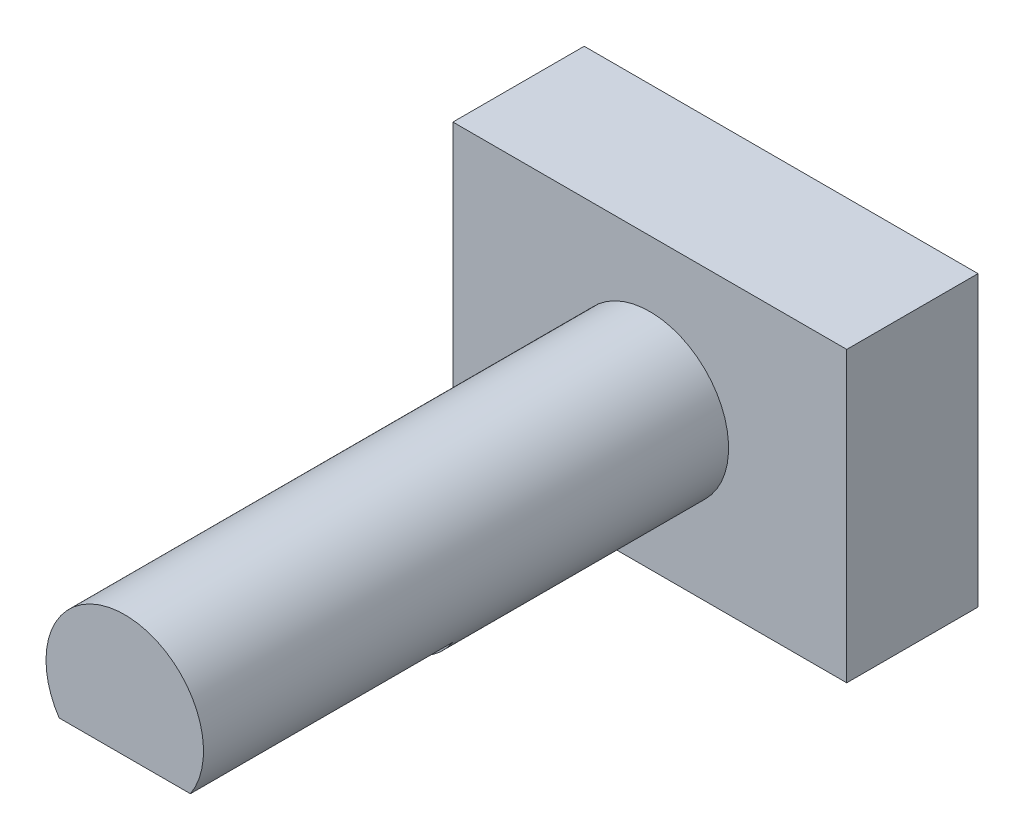
ISO-10303-21;
HEADER;
FILE_DESCRIPTION(('STEP AP214'),'2;1');
FILE_NAME('part.step','',(''),(''),'','','');
FILE_SCHEMA(('AUTOMOTIVE_DESIGN { 1 0 10303 214 1 1 1 1 }'));
ENDSEC;
DATA;
#1=APPLICATION_CONTEXT('core data for automotive mechanical design processes');
#2=APPLICATION_PROTOCOL_DEFINITION('international standard','automotive_design',2000,#1);
#3=PRODUCT_CONTEXT('',#1,'mechanical');
#4=PRODUCT('Part','Part','',(#3));
#5=PRODUCT_RELATED_PRODUCT_CATEGORY('part','',(#4));
#6=PRODUCT_DEFINITION_FORMATION('','',#4);
#7=PRODUCT_DEFINITION_CONTEXT('part definition',#1,'design');
#8=PRODUCT_DEFINITION('design','',#6,#7);
#9=PRODUCT_DEFINITION_SHAPE('','',#8);
#10=(LENGTH_UNIT() NAMED_UNIT(*) SI_UNIT(.MILLI.,.METRE.));
#11=(NAMED_UNIT(*) PLANE_ANGLE_UNIT() SI_UNIT($,.RADIAN.));
#12=(NAMED_UNIT(*) SI_UNIT($,.STERADIAN.) SOLID_ANGLE_UNIT());
#13=UNCERTAINTY_MEASURE_WITH_UNIT(LENGTH_MEASURE(1.E-05),#10,'distance_accuracy_value','');
#14=(GEOMETRIC_REPRESENTATION_CONTEXT(3) GLOBAL_UNCERTAINTY_ASSIGNED_CONTEXT((#13)) GLOBAL_UNIT_ASSIGNED_CONTEXT((#10,
#11,#12)) REPRESENTATION_CONTEXT('',''));
#15=CARTESIAN_POINT('',(0.,0.,0.));
#16=DIRECTION('',(0.,0.,1.));
#17=DIRECTION('',(1.,0.,0.));
#18=AXIS2_PLACEMENT_3D('',#15,#16,#17);
#19=CARTESIAN_POINT('',(-7.5,-5.5,5.));
#20=DIRECTION('',(1.,0.,0.));
#21=DIRECTION('',(0.,0.,-1.));
#22=AXIS2_PLACEMENT_3D('',#19,#20,#21);
#23=PLANE('',#22);
#24=DIRECTION('',(0.,-1.,0.));
#25=VECTOR('',#24,1.);
#26=CARTESIAN_POINT('',(-7.5,-5.5,0.));
#27=LINE('',#26,#25);
#28=CARTESIAN_POINT('',(-7.5,5.5,0.));
#29=VERTEX_POINT('',#28);
#30=CARTESIAN_POINT('',(-7.5,-5.5,0.));
#31=VERTEX_POINT('',#30);
#32=EDGE_CURVE('E116',#29,#31,#27,.T.);
#33=ORIENTED_EDGE('',*,*,#32,.T.);
#34=DIRECTION('',(0.,0.,-1.));
#35=VECTOR('',#34,1.);
#36=CARTESIAN_POINT('',(-7.5,-5.5,5.));
#37=LINE('',#36,#35);
#38=CARTESIAN_POINT('',(-7.5,-5.5,5.));
#39=VERTEX_POINT('',#38);
#40=EDGE_CURVE('E40',#39,#31,#37,.T.);
#41=ORIENTED_EDGE('',*,*,#40,.F.);
#42=DIRECTION('',(0.,-1.,0.));
#43=VECTOR('',#42,1.);
#44=CARTESIAN_POINT('',(-7.5,-5.5,5.));
#45=LINE('',#44,#43);
#46=CARTESIAN_POINT('',(-7.5,5.5,5.));
#47=VERTEX_POINT('',#46);
#48=EDGE_CURVE('E117',#47,#39,#45,.T.);
#49=ORIENTED_EDGE('',*,*,#48,.F.);
#50=DIRECTION('',(0.,0.,-1.));
#51=VECTOR('',#50,1.);
#52=CARTESIAN_POINT('',(-7.5,5.5,5.));
#53=LINE('',#52,#51);
#54=EDGE_CURVE('E123',#47,#29,#53,.T.);
#55=ORIENTED_EDGE('',*,*,#54,.T.);
#56=EDGE_LOOP('',(#33,#41,#49,#55));
#57=FACE_BOUND('',#56,.T.);
#58=ADVANCED_FACE('F33',(#57),#23,.F.);
#59=CARTESIAN_POINT('',(-7.5,-5.5,5.));
#60=DIRECTION('',(0.,1.,0.));
#61=DIRECTION('',(0.,0.,1.));
#62=AXIS2_PLACEMENT_3D('',#59,#60,#61);
#63=PLANE('',#62);
#64=DIRECTION('',(1.,0.,0.));
#65=VECTOR('',#64,1.);
#66=CARTESIAN_POINT('',(-7.5,-5.5,0.));
#67=LINE('',#66,#65);
#68=CARTESIAN_POINT('',(7.5,-5.5,0.));
#69=VERTEX_POINT('',#68);
#70=EDGE_CURVE('E126',#31,#69,#67,.T.);
#71=ORIENTED_EDGE('',*,*,#70,.T.);
#72=DIRECTION('',(0.,0.,-1.));
#73=VECTOR('',#72,1.);
#74=CARTESIAN_POINT('',(7.5,-5.5,5.));
#75=LINE('',#74,#73);
#76=CARTESIAN_POINT('',(7.5,-5.5,5.));
#77=VERTEX_POINT('',#76);
#78=EDGE_CURVE('E134',#77,#69,#75,.T.);
#79=ORIENTED_EDGE('',*,*,#78,.F.);
#80=DIRECTION('',(1.,0.,0.));
#81=VECTOR('',#80,1.);
#82=CARTESIAN_POINT('',(-7.5,-5.5,5.));
#83=LINE('',#82,#81);
#84=EDGE_CURVE('E85',#39,#77,#83,.T.);
#85=ORIENTED_EDGE('',*,*,#84,.F.);
#86=ORIENTED_EDGE('',*,*,#40,.T.);
#87=EDGE_LOOP('',(#71,#79,#85,#86));
#88=FACE_BOUND('',#87,.T.);
#89=ADVANCED_FACE('F137',(#88),#63,.F.);
#90=CARTESIAN_POINT('',(7.5,-5.5,5.));
#91=DIRECTION('',(-1.,0.,0.));
#92=DIRECTION('',(0.,0.,1.));
#93=AXIS2_PLACEMENT_3D('',#90,#91,#92);
#94=PLANE('',#93);
#95=DIRECTION('',(0.,1.,0.));
#96=VECTOR('',#95,1.);
#97=CARTESIAN_POINT('',(7.5,-5.5,0.));
#98=LINE('',#97,#96);
#99=CARTESIAN_POINT('',(7.5,5.5,0.));
#100=VERTEX_POINT('',#99);
#101=EDGE_CURVE('E128',#69,#100,#98,.T.);
#102=ORIENTED_EDGE('',*,*,#101,.T.);
#103=DIRECTION('',(0.,0.,-1.));
#104=VECTOR('',#103,1.);
#105=CARTESIAN_POINT('',(7.5,5.5,5.));
#106=LINE('',#105,#104);
#107=CARTESIAN_POINT('',(7.5,5.5,5.));
#108=VERTEX_POINT('',#107);
#109=EDGE_CURVE('E132',#108,#100,#106,.T.);
#110=ORIENTED_EDGE('',*,*,#109,.F.);
#111=DIRECTION('',(0.,1.,0.));
#112=VECTOR('',#111,1.);
#113=CARTESIAN_POINT('',(7.5,-5.5,5.));
#114=LINE('',#113,#112);
#115=EDGE_CURVE('E120',#77,#108,#114,.T.);
#116=ORIENTED_EDGE('',*,*,#115,.F.);
#117=ORIENTED_EDGE('',*,*,#78,.T.);
#118=EDGE_LOOP('',(#102,#110,#116,#117));
#119=FACE_BOUND('',#118,.T.);
#120=ADVANCED_FACE('F146',(#119),#94,.F.);
#121=CARTESIAN_POINT('',(-7.5,5.5,5.));
#122=DIRECTION('',(0.,-1.,0.));
#123=DIRECTION('',(0.,0.,-1.));
#124=AXIS2_PLACEMENT_3D('',#121,#122,#123);
#125=PLANE('',#124);
#126=DIRECTION('',(-1.,0.,0.));
#127=VECTOR('',#126,1.);
#128=CARTESIAN_POINT('',(-7.5,5.5,0.));
#129=LINE('',#128,#127);
#130=EDGE_CURVE('E77',#100,#29,#129,.T.);
#131=ORIENTED_EDGE('',*,*,#130,.T.);
#132=ORIENTED_EDGE('',*,*,#54,.F.);
#133=DIRECTION('',(-1.,0.,0.));
#134=VECTOR('',#133,1.);
#135=CARTESIAN_POINT('',(-7.5,5.5,5.));
#136=LINE('',#135,#134);
#137=EDGE_CURVE('E56',#108,#47,#136,.T.);
#138=ORIENTED_EDGE('',*,*,#137,.F.);
#139=ORIENTED_EDGE('',*,*,#109,.T.);
#140=EDGE_LOOP('',(#131,#132,#138,#139));
#141=FACE_BOUND('',#140,.T.);
#142=ADVANCED_FACE('F148',(#141),#125,.F.);
#143=CARTESIAN_POINT('',(0.,0.,5.));
#144=DIRECTION('',(0.,0.,-1.));
#145=DIRECTION('',(-1.,0.,0.));
#146=AXIS2_PLACEMENT_3D('',#143,#144,#145);
#147=PLANE('',#146);
#148=CARTESIAN_POINT('',(0.,0.,5.));
#149=DIRECTION('',(0.,0.,-1.));
#150=DIRECTION('',(-1.,0.,0.));
#151=AXIS2_PLACEMENT_3D('',#148,#149,#150);
#152=CIRCLE('',#151,3.);
#153=CARTESIAN_POINT('',(-3.,0.,5.));
#154=VERTEX_POINT('',#153);
#155=EDGE_CURVE('E11',#154,#154,#152,.F.);
#156=ORIENTED_EDGE('',*,*,#155,.F.);
#157=EDGE_LOOP('',(#156));
#158=FACE_BOUND('',#157,.T.);
#159=ORIENTED_EDGE('',*,*,#48,.T.);
#160=ORIENTED_EDGE('',*,*,#84,.T.);
#161=ORIENTED_EDGE('',*,*,#115,.T.);
#162=ORIENTED_EDGE('',*,*,#137,.T.);
#163=EDGE_LOOP('',(#159,#160,#161,#162));
#164=FACE_BOUND('',#163,.T.);
#165=ADVANCED_FACE('F149',(#158,#164),#147,.F.);
#166=CARTESIAN_POINT('',(0.,0.,0.));
#167=DIRECTION('',(0.,0.,-1.));
#168=DIRECTION('',(-1.,0.,0.));
#169=AXIS2_PLACEMENT_3D('',#166,#167,#168);
#170=PLANE('',#169);
#171=ORIENTED_EDGE('',*,*,#32,.F.);
#172=ORIENTED_EDGE('',*,*,#130,.F.);
#173=ORIENTED_EDGE('',*,*,#101,.F.);
#174=ORIENTED_EDGE('',*,*,#70,.F.);
#175=EDGE_LOOP('',(#171,#172,#173,#174));
#176=FACE_BOUND('',#175,.T.);
#177=ADVANCED_FACE('F142',(#176),#170,.T.);
#178=CARTESIAN_POINT('',(0.,0.,25.));
#179=DIRECTION('',(0.,0.,-1.));
#180=DIRECTION('',(-1.,0.,0.));
#181=AXIS2_PLACEMENT_3D('',#178,#179,#180);
#182=CYLINDRICAL_SURFACE('',#181,3.);
#183=CARTESIAN_POINT('',(0.,0.,25.));
#184=DIRECTION('',(0.,0.,1.));
#185=DIRECTION('',(1.,0.,0.));
#186=AXIS2_PLACEMENT_3D('',#183,#184,#185);
#187=CIRCLE('',#186,3.);
#188=CARTESIAN_POINT('',(2.5,-1.6583123951777,25.));
#189=VERTEX_POINT('',#188);
#190=CARTESIAN_POINT('',(-2.5,-1.6583123951777,25.));
#191=VERTEX_POINT('',#190);
#192=EDGE_CURVE('E110',#189,#191,#187,.T.);
#193=ORIENTED_EDGE('',*,*,#192,.F.);
#194=DIRECTION('',(0.,0.,1.));
#195=VECTOR('',#194,1.);
#196=CARTESIAN_POINT('',(2.5,-1.6583123951777,15.));
#197=LINE('',#196,#195);
#198=CARTESIAN_POINT('',(2.5,-1.6583123951777,15.));
#199=VERTEX_POINT('',#198);
#200=EDGE_CURVE('E47',#199,#189,#197,.T.);
#201=ORIENTED_EDGE('',*,*,#200,.F.);
#202=CARTESIAN_POINT('',(0.,0.,15.));
#203=DIRECTION('',(0.,0.,1.));
#204=DIRECTION('',(1.,0.,0.));
#205=AXIS2_PLACEMENT_3D('',#202,#203,#204);
#206=CIRCLE('',#205,3.);
#207=CARTESIAN_POINT('',(-2.5,-1.6583123951777,15.));
#208=VERTEX_POINT('',#207);
#209=EDGE_CURVE('E96',#208,#199,#206,.T.);
#210=ORIENTED_EDGE('',*,*,#209,.F.);
#211=DIRECTION('',(0.,0.,1.));
#212=VECTOR('',#211,1.);
#213=CARTESIAN_POINT('',(-2.5,-1.6583123951777,15.));
#214=LINE('',#213,#212);
#215=EDGE_CURVE('E104',#208,#191,#214,.T.);
#216=ORIENTED_EDGE('',*,*,#215,.T.);
#217=EDGE_LOOP('',(#193,#201,#210,#216));
#218=FACE_BOUND('',#217,.T.);
#219=ORIENTED_EDGE('',*,*,#155,.T.);
#220=EDGE_LOOP('',(#219));
#221=FACE_BOUND('',#220,.T.);
#222=ADVANCED_FACE('F107',(#218,#221),#182,.T.);
#223=CARTESIAN_POINT('',(0.,0.,25.));
#224=DIRECTION('',(0.,0.,1.));
#225=DIRECTION('',(1.,0.,0.));
#226=AXIS2_PLACEMENT_3D('',#223,#224,#225);
#227=PLANE('',#226);
#228=DIRECTION('',(-1.,0.,0.));
#229=VECTOR('',#228,1.);
#230=CARTESIAN_POINT('',(-2.5,-1.6583123951777,25.));
#231=LINE('',#230,#229);
#232=EDGE_CURVE('E101',#189,#191,#231,.T.);
#233=ORIENTED_EDGE('',*,*,#232,.F.);
#234=ORIENTED_EDGE('',*,*,#192,.T.);
#235=EDGE_LOOP('',(#233,#234));
#236=FACE_BOUND('',#235,.T.);
#237=ADVANCED_FACE('F194',(#236),#227,.T.);
#238=CARTESIAN_POINT('',(-2.5,-1.6583123951777,15.));
#239=DIRECTION('',(0.,1.,0.));
#240=DIRECTION('',(0.,0.,1.));
#241=AXIS2_PLACEMENT_3D('',#238,#239,#240);
#242=PLANE('',#241);
#243=ORIENTED_EDGE('',*,*,#232,.T.);
#244=ORIENTED_EDGE('',*,*,#215,.F.);
#245=DIRECTION('',(-1.,0.,0.));
#246=VECTOR('',#245,1.);
#247=CARTESIAN_POINT('',(-2.5,-1.6583123951777,15.));
#248=LINE('',#247,#246);
#249=EDGE_CURVE('E98',#199,#208,#248,.T.);
#250=ORIENTED_EDGE('',*,*,#249,.F.);
#251=ORIENTED_EDGE('',*,*,#200,.T.);
#252=EDGE_LOOP('',(#243,#244,#250,#251));
#253=FACE_BOUND('',#252,.T.);
#254=ADVANCED_FACE('F103',(#253),#242,.F.);
#255=CARTESIAN_POINT('',(0.,0.,15.));
#256=DIRECTION('',(0.,0.,1.));
#257=DIRECTION('',(1.,0.,0.));
#258=AXIS2_PLACEMENT_3D('',#255,#256,#257);
#259=PLANE('',#258);
#260=ORIENTED_EDGE('',*,*,#209,.T.);
#261=ORIENTED_EDGE('',*,*,#249,.T.);
#262=EDGE_LOOP('',(#260,#261));
#263=FACE_BOUND('',#262,.T.);
#264=ADVANCED_FACE('F97',(#263),#259,.T.);
#265=CLOSED_SHELL('',(#58,#89,#120,#142,#165,#177,#222,#237,#254,#264));
#266=MANIFOLD_SOLID_BREP('B2',#265);
#267=ADVANCED_BREP_SHAPE_REPRESENTATION('',(#18,#266),#14);
#268=SHAPE_DEFINITION_REPRESENTATION(#9,#267);
ENDSEC;
END-ISO-10303-21;
